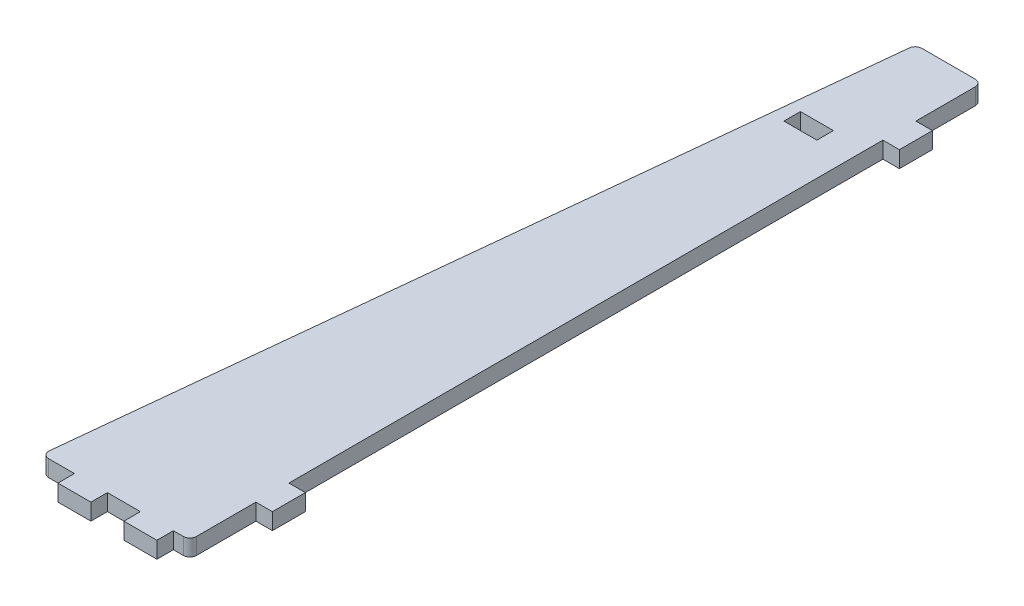
ISO-10303-21;
HEADER;
FILE_DESCRIPTION(('STEP AP214'),'2;1');
FILE_NAME('part.step','',(''),(''),'','','');
FILE_SCHEMA(('AUTOMOTIVE_DESIGN { 1 0 10303 214 1 1 1 1 }'));
ENDSEC;
DATA;
#1=APPLICATION_CONTEXT('core data for automotive mechanical design processes');
#2=APPLICATION_PROTOCOL_DEFINITION('international standard','automotive_design',2000,#1);
#3=PRODUCT_CONTEXT('',#1,'mechanical');
#4=PRODUCT('Part','Part','',(#3));
#5=PRODUCT_RELATED_PRODUCT_CATEGORY('part','',(#4));
#6=PRODUCT_DEFINITION_FORMATION('','',#4);
#7=PRODUCT_DEFINITION_CONTEXT('part definition',#1,'design');
#8=PRODUCT_DEFINITION('design','',#6,#7);
#9=PRODUCT_DEFINITION_SHAPE('','',#8);
#10=(LENGTH_UNIT() NAMED_UNIT(*) SI_UNIT(.MILLI.,.METRE.));
#11=(NAMED_UNIT(*) PLANE_ANGLE_UNIT() SI_UNIT($,.RADIAN.));
#12=(NAMED_UNIT(*) SI_UNIT($,.STERADIAN.) SOLID_ANGLE_UNIT());
#13=UNCERTAINTY_MEASURE_WITH_UNIT(LENGTH_MEASURE(1.E-05),#10,'distance_accuracy_value','');
#14=(GEOMETRIC_REPRESENTATION_CONTEXT(3) GLOBAL_UNCERTAINTY_ASSIGNED_CONTEXT((#13)) GLOBAL_UNIT_ASSIGNED_CONTEXT((#10,
#11,#12)) REPRESENTATION_CONTEXT('',''));
#15=CARTESIAN_POINT('',(0.,0.,0.));
#16=DIRECTION('',(0.,0.,1.));
#17=DIRECTION('',(1.,0.,0.));
#18=AXIS2_PLACEMENT_3D('',#15,#16,#17);
#19=CARTESIAN_POINT('',(0.,6.35,0.));
#20=DIRECTION('',(0.,1.,0.));
#21=DIRECTION('',(0.,0.,1.));
#22=AXIS2_PLACEMENT_3D('',#19,#20,#21);
#23=PLANE('',#22);
#24=DIRECTION('',(1.,0.,0.));
#25=VECTOR('',#24,1.);
#26=CARTESIAN_POINT('',(50.8,6.35,0.));
#27=LINE('',#26,#25);
#28=CARTESIAN_POINT('',(50.8,6.35,0.));
#29=VERTEX_POINT('',#28);
#30=CARTESIAN_POINT('',(54.61,6.35,0.));
#31=VERTEX_POINT('',#30);
#32=EDGE_CURVE('E282',#29,#31,#27,.T.);
#33=ORIENTED_EDGE('',*,*,#32,.T.);
#34=CARTESIAN_POINT('',(54.61,6.35,-2.54));
#35=DIRECTION('',(0.,1.,0.));
#36=DIRECTION('',(0.,0.,1.));
#37=AXIS2_PLACEMENT_3D('',#34,#35,#36);
#38=CIRCLE('',#37,2.54);
#39=CARTESIAN_POINT('',(57.15,6.35,-2.54));
#40=VERTEX_POINT('',#39);
#41=EDGE_CURVE('E412',#31,#40,#38,.T.);
#42=ORIENTED_EDGE('',*,*,#41,.T.);
#43=DIRECTION('',(0.,0.,-1.));
#44=VECTOR('',#43,1.);
#45=CARTESIAN_POINT('',(57.15,6.35,0.));
#46=LINE('',#45,#44);
#47=CARTESIAN_POINT('',(57.15,6.35,-25.4));
#48=VERTEX_POINT('',#47);
#49=EDGE_CURVE('E285',#40,#48,#46,.T.);
#50=ORIENTED_EDGE('',*,*,#49,.T.);
#51=DIRECTION('',(1.,0.,0.));
#52=VECTOR('',#51,1.);
#53=CARTESIAN_POINT('',(57.15,6.35,-25.4));
#54=LINE('',#53,#52);
#55=CARTESIAN_POINT('',(63.5,6.35,-25.4));
#56=VERTEX_POINT('',#55);
#57=EDGE_CURVE('E287',#48,#56,#54,.T.);
#58=ORIENTED_EDGE('',*,*,#57,.T.);
#59=DIRECTION('',(0.,0.,-1.));
#60=VECTOR('',#59,1.);
#61=CARTESIAN_POINT('',(63.5,6.35,-25.4));
#62=LINE('',#61,#60);
#63=CARTESIAN_POINT('',(63.5,6.35,-38.1));
#64=VERTEX_POINT('',#63);
#65=EDGE_CURVE('E289',#56,#64,#62,.T.);
#66=ORIENTED_EDGE('',*,*,#65,.T.);
#67=DIRECTION('',(-1.,0.,0.));
#68=VECTOR('',#67,1.);
#69=CARTESIAN_POINT('',(63.5,6.35,-38.1));
#70=LINE('',#69,#68);
#71=CARTESIAN_POINT('',(57.15,6.35,-38.1));
#72=VERTEX_POINT('',#71);
#73=EDGE_CURVE('E291',#64,#72,#70,.T.);
#74=ORIENTED_EDGE('',*,*,#73,.T.);
#75=DIRECTION('',(0.,0.,-1.));
#76=VECTOR('',#75,1.);
#77=CARTESIAN_POINT('',(57.15,6.35,-38.1));
#78=LINE('',#77,#76);
#79=CARTESIAN_POINT('',(57.15,6.35,-266.7));
#80=VERTEX_POINT('',#79);
#81=EDGE_CURVE('E293',#72,#80,#78,.T.);
#82=ORIENTED_EDGE('',*,*,#81,.T.);
#83=DIRECTION('',(1.,0.,0.));
#84=VECTOR('',#83,1.);
#85=CARTESIAN_POINT('',(57.15,6.35,-266.7));
#86=LINE('',#85,#84);
#87=CARTESIAN_POINT('',(63.5,6.35,-266.7));
#88=VERTEX_POINT('',#87);
#89=EDGE_CURVE('E295',#80,#88,#86,.T.);
#90=ORIENTED_EDGE('',*,*,#89,.T.);
#91=DIRECTION('',(0.,0.,-1.));
#92=VECTOR('',#91,1.);
#93=CARTESIAN_POINT('',(63.5,6.35,-266.7));
#94=LINE('',#93,#92);
#95=CARTESIAN_POINT('',(63.5,6.35,-279.4));
#96=VERTEX_POINT('',#95);
#97=EDGE_CURVE('E297',#88,#96,#94,.T.);
#98=ORIENTED_EDGE('',*,*,#97,.T.);
#99=DIRECTION('',(-1.,0.,0.));
#100=VECTOR('',#99,1.);
#101=CARTESIAN_POINT('',(63.5,6.35,-279.4));
#102=LINE('',#101,#100);
#103=CARTESIAN_POINT('',(57.15,6.35,-279.4));
#104=VERTEX_POINT('',#103);
#105=EDGE_CURVE('E299',#96,#104,#102,.T.);
#106=ORIENTED_EDGE('',*,*,#105,.T.);
#107=DIRECTION('',(0.,0.,-1.));
#108=VECTOR('',#107,1.);
#109=CARTESIAN_POINT('',(57.15,6.35,-279.4));
#110=LINE('',#109,#108);
#111=CARTESIAN_POINT('',(57.15,6.35,-302.26));
#112=VERTEX_POINT('',#111);
#113=EDGE_CURVE('E301',#104,#112,#110,.T.);
#114=ORIENTED_EDGE('',*,*,#113,.T.);
#115=CARTESIAN_POINT('',(54.61,6.35,-302.26));
#116=DIRECTION('',(0.,1.,0.));
#117=DIRECTION('',(0.,0.,1.));
#118=AXIS2_PLACEMENT_3D('',#115,#116,#117);
#119=CIRCLE('',#118,2.54);
#120=CARTESIAN_POINT('',(54.61,6.35,-304.8));
#121=VERTEX_POINT('',#120);
#122=EDGE_CURVE('E55',#112,#121,#119,.T.);
#123=ORIENTED_EDGE('',*,*,#122,.T.);
#124=DIRECTION('',(-1.,0.,0.));
#125=VECTOR('',#124,1.);
#126=CARTESIAN_POINT('',(57.15,6.35,-304.8));
#127=LINE('',#126,#125);
#128=CARTESIAN_POINT('',(34.0391598683762,6.35,-304.8));
#129=VERTEX_POINT('',#128);
#130=EDGE_CURVE('E303',#121,#129,#127,.T.);
#131=ORIENTED_EDGE('',*,*,#130,.T.);
#132=CARTESIAN_POINT('',(34.0391598683762,6.35,-302.26));
#133=DIRECTION('',(0.,1.,0.));
#134=DIRECTION('',(0.,0.,1.));
#135=AXIS2_PLACEMENT_3D('',#132,#133,#134);
#136=CIRCLE('',#135,2.54);
#137=CARTESIAN_POINT('',(31.5128291097936,6.35,-302.523159454019));
#138=VERTEX_POINT('',#137);
#139=EDGE_CURVE('E409',#129,#138,#136,.T.);
#140=ORIENTED_EDGE('',*,*,#139,.T.);
#141=DIRECTION('',(-0.103606084259456,0.,0.994618408890778));
#142=VECTOR('',#141,1.);
#143=CARTESIAN_POINT('',(31.75,6.35,-304.8));
#144=LINE('',#143,#142);
#145=CARTESIAN_POINT('',(0.291995776460316,6.35,-2.80315945401904));
#146=VERTEX_POINT('',#145);
#147=EDGE_CURVE('E262',#138,#146,#144,.T.);
#148=ORIENTED_EDGE('',*,*,#147,.T.);
#149=CARTESIAN_POINT('',(2.81832653504289,6.35,-2.54));
#150=DIRECTION('',(0.,1.,0.));
#151=DIRECTION('',(0.,0.,1.));
#152=AXIS2_PLACEMENT_3D('',#149,#150,#151);
#153=CIRCLE('',#152,2.54);
#154=CARTESIAN_POINT('',(2.81832653504289,6.35,0.));
#155=VERTEX_POINT('',#154);
#156=EDGE_CURVE('E407',#146,#155,#153,.T.);
#157=ORIENTED_EDGE('',*,*,#156,.T.);
#158=DIRECTION('',(1.,0.,0.));
#159=VECTOR('',#158,1.);
#160=CARTESIAN_POINT('',(0.,6.35,0.));
#161=LINE('',#160,#159);
#162=CARTESIAN_POINT('',(12.7,6.35,0.));
#163=VERTEX_POINT('',#162);
#164=EDGE_CURVE('E265',#155,#163,#161,.T.);
#165=ORIENTED_EDGE('',*,*,#164,.T.);
#166=DIRECTION('',(0.,0.,1.));
#167=VECTOR('',#166,1.);
#168=CARTESIAN_POINT('',(12.7,6.35,0.));
#169=LINE('',#168,#167);
#170=CARTESIAN_POINT('',(12.7,6.35,6.35));
#171=VERTEX_POINT('',#170);
#172=EDGE_CURVE('E268',#163,#171,#169,.T.);
#173=ORIENTED_EDGE('',*,*,#172,.T.);
#174=DIRECTION('',(1.,0.,0.));
#175=VECTOR('',#174,1.);
#176=CARTESIAN_POINT('',(12.7,6.35,6.35));
#177=LINE('',#176,#175);
#178=CARTESIAN_POINT('',(25.4,6.35,6.35));
#179=VERTEX_POINT('',#178);
#180=EDGE_CURVE('E270',#171,#179,#177,.T.);
#181=ORIENTED_EDGE('',*,*,#180,.T.);
#182=DIRECTION('',(0.,0.,-1.));
#183=VECTOR('',#182,1.);
#184=CARTESIAN_POINT('',(25.4,6.35,6.35));
#185=LINE('',#184,#183);
#186=CARTESIAN_POINT('',(25.4,6.35,0.));
#187=VERTEX_POINT('',#186);
#188=EDGE_CURVE('E272',#179,#187,#185,.T.);
#189=ORIENTED_EDGE('',*,*,#188,.T.);
#190=DIRECTION('',(1.,0.,0.));
#191=VECTOR('',#190,1.);
#192=CARTESIAN_POINT('',(25.4,6.35,0.));
#193=LINE('',#192,#191);
#194=CARTESIAN_POINT('',(38.1,6.35,0.));
#195=VERTEX_POINT('',#194);
#196=EDGE_CURVE('E274',#187,#195,#193,.T.);
#197=ORIENTED_EDGE('',*,*,#196,.T.);
#198=DIRECTION('',(0.,0.,1.));
#199=VECTOR('',#198,1.);
#200=CARTESIAN_POINT('',(38.1,6.35,0.));
#201=LINE('',#200,#199);
#202=CARTESIAN_POINT('',(38.1,6.35,6.35));
#203=VERTEX_POINT('',#202);
#204=EDGE_CURVE('E276',#195,#203,#201,.T.);
#205=ORIENTED_EDGE('',*,*,#204,.T.);
#206=DIRECTION('',(1.,0.,0.));
#207=VECTOR('',#206,1.);
#208=CARTESIAN_POINT('',(38.1,6.35,6.35));
#209=LINE('',#208,#207);
#210=CARTESIAN_POINT('',(50.8,6.35,6.35));
#211=VERTEX_POINT('',#210);
#212=EDGE_CURVE('E278',#203,#211,#209,.T.);
#213=ORIENTED_EDGE('',*,*,#212,.T.);
#214=DIRECTION('',(0.,0.,-1.));
#215=VECTOR('',#214,1.);
#216=CARTESIAN_POINT('',(50.8,6.35,6.35));
#217=LINE('',#216,#215);
#218=EDGE_CURVE('E280',#211,#29,#217,.T.);
#219=ORIENTED_EDGE('',*,*,#218,.T.);
#220=EDGE_LOOP('',(#33,#42,#50,#58,#66,#74,#82,#90,#98,#106,#114,#123,#131,#140,#148,#157,#165,
#173,#181,#189,#197,#205,#213,#219));
#221=FACE_BOUND('',#220,.T.);
#222=DIRECTION('',(0.,0.,1.));
#223=VECTOR('',#222,1.);
#224=CARTESIAN_POINT('',(31.75,6.35,-260.35));
#225=LINE('',#224,#223);
#226=CARTESIAN_POINT('',(31.75,6.35,-260.35));
#227=VERTEX_POINT('',#226);
#228=CARTESIAN_POINT('',(31.75,6.35,-254.));
#229=VERTEX_POINT('',#228);
#230=EDGE_CURVE('E231',#227,#229,#225,.T.);
#231=ORIENTED_EDGE('',*,*,#230,.F.);
#232=DIRECTION('',(-1.,0.,0.));
#233=VECTOR('',#232,1.);
#234=CARTESIAN_POINT('',(31.75,6.35,-260.35));
#235=LINE('',#234,#233);
#236=CARTESIAN_POINT('',(44.45,6.35,-260.35));
#237=VERTEX_POINT('',#236);
#238=EDGE_CURVE('E221',#237,#227,#235,.T.);
#239=ORIENTED_EDGE('',*,*,#238,.F.);
#240=DIRECTION('',(0.,0.,-1.));
#241=VECTOR('',#240,1.);
#242=CARTESIAN_POINT('',(44.45,6.35,-260.35));
#243=LINE('',#242,#241);
#244=CARTESIAN_POINT('',(44.45,6.35,-254.));
#245=VERTEX_POINT('',#244);
#246=EDGE_CURVE('E246',#245,#237,#243,.T.);
#247=ORIENTED_EDGE('',*,*,#246,.F.);
#248=DIRECTION('',(1.,0.,0.));
#249=VECTOR('',#248,1.);
#250=CARTESIAN_POINT('',(31.75,6.35,-254.));
#251=LINE('',#250,#249);
#252=EDGE_CURVE('E244',#229,#245,#251,.T.);
#253=ORIENTED_EDGE('',*,*,#252,.F.);
#254=EDGE_LOOP('',(#231,#239,#247,#253));
#255=FACE_BOUND('',#254,.T.);
#256=ADVANCED_FACE('F33',(#221,#255),#23,.T.);
#257=CARTESIAN_POINT('',(0.,0.,0.));
#258=DIRECTION('',(0.,1.,0.));
#259=DIRECTION('',(0.,0.,1.));
#260=AXIS2_PLACEMENT_3D('',#257,#258,#259);
#261=PLANE('',#260);
#262=DIRECTION('',(0.,0.,-1.));
#263=VECTOR('',#262,1.);
#264=CARTESIAN_POINT('',(57.15,0.,0.));
#265=LINE('',#264,#263);
#266=CARTESIAN_POINT('',(57.15,0.,-2.54));
#267=VERTEX_POINT('',#266);
#268=CARTESIAN_POINT('',(57.15,0.,-25.4));
#269=VERTEX_POINT('',#268);
#270=EDGE_CURVE('E327',#267,#269,#265,.T.);
#271=ORIENTED_EDGE('',*,*,#270,.F.);
#272=CARTESIAN_POINT('',(54.61,0.,-2.54));
#273=DIRECTION('',(0.,1.,0.));
#274=DIRECTION('',(0.,0.,1.));
#275=AXIS2_PLACEMENT_3D('',#272,#273,#274);
#276=CIRCLE('',#275,2.54);
#277=CARTESIAN_POINT('',(54.61,0.,0.));
#278=VERTEX_POINT('',#277);
#279=EDGE_CURVE('E403',#267,#278,#276,.F.);
#280=ORIENTED_EDGE('',*,*,#279,.T.);
#281=DIRECTION('',(1.,0.,0.));
#282=VECTOR('',#281,1.);
#283=CARTESIAN_POINT('',(50.8,0.,0.));
#284=LINE('',#283,#282);
#285=CARTESIAN_POINT('',(50.8,0.,0.));
#286=VERTEX_POINT('',#285);
#287=EDGE_CURVE('E324',#286,#278,#284,.T.);
#288=ORIENTED_EDGE('',*,*,#287,.F.);
#289=DIRECTION('',(0.,0.,-1.));
#290=VECTOR('',#289,1.);
#291=CARTESIAN_POINT('',(50.8,0.,6.35));
#292=LINE('',#291,#290);
#293=CARTESIAN_POINT('',(50.8,0.,6.35));
#294=VERTEX_POINT('',#293);
#295=EDGE_CURVE('E322',#294,#286,#292,.T.);
#296=ORIENTED_EDGE('',*,*,#295,.F.);
#297=DIRECTION('',(1.,0.,0.));
#298=VECTOR('',#297,1.);
#299=CARTESIAN_POINT('',(38.1,0.,6.35));
#300=LINE('',#299,#298);
#301=CARTESIAN_POINT('',(38.1,0.,6.35));
#302=VERTEX_POINT('',#301);
#303=EDGE_CURVE('E320',#302,#294,#300,.T.);
#304=ORIENTED_EDGE('',*,*,#303,.F.);
#305=DIRECTION('',(0.,0.,1.));
#306=VECTOR('',#305,1.);
#307=CARTESIAN_POINT('',(38.1,0.,0.));
#308=LINE('',#307,#306);
#309=CARTESIAN_POINT('',(38.1,0.,0.));
#310=VERTEX_POINT('',#309);
#311=EDGE_CURVE('E318',#310,#302,#308,.T.);
#312=ORIENTED_EDGE('',*,*,#311,.F.);
#313=DIRECTION('',(1.,0.,0.));
#314=VECTOR('',#313,1.);
#315=CARTESIAN_POINT('',(25.4,0.,0.));
#316=LINE('',#315,#314);
#317=CARTESIAN_POINT('',(25.4,0.,0.));
#318=VERTEX_POINT('',#317);
#319=EDGE_CURVE('E316',#318,#310,#316,.T.);
#320=ORIENTED_EDGE('',*,*,#319,.F.);
#321=DIRECTION('',(0.,0.,-1.));
#322=VECTOR('',#321,1.);
#323=CARTESIAN_POINT('',(25.4,0.,6.35));
#324=LINE('',#323,#322);
#325=CARTESIAN_POINT('',(25.4,0.,6.35));
#326=VERTEX_POINT('',#325);
#327=EDGE_CURVE('E314',#326,#318,#324,.T.);
#328=ORIENTED_EDGE('',*,*,#327,.F.);
#329=DIRECTION('',(1.,0.,0.));
#330=VECTOR('',#329,1.);
#331=CARTESIAN_POINT('',(12.7,0.,6.35));
#332=LINE('',#331,#330);
#333=CARTESIAN_POINT('',(12.7,0.,6.35));
#334=VERTEX_POINT('',#333);
#335=EDGE_CURVE('E312',#334,#326,#332,.T.);
#336=ORIENTED_EDGE('',*,*,#335,.F.);
#337=DIRECTION('',(0.,0.,1.));
#338=VECTOR('',#337,1.);
#339=CARTESIAN_POINT('',(12.7,0.,0.));
#340=LINE('',#339,#338);
#341=CARTESIAN_POINT('',(12.7,0.,0.));
#342=VERTEX_POINT('',#341);
#343=EDGE_CURVE('E310',#342,#334,#340,.T.);
#344=ORIENTED_EDGE('',*,*,#343,.F.);
#345=DIRECTION('',(1.,0.,0.));
#346=VECTOR('',#345,1.);
#347=CARTESIAN_POINT('',(0.,0.,0.));
#348=LINE('',#347,#346);
#349=CARTESIAN_POINT('',(2.81832653504289,0.,0.));
#350=VERTEX_POINT('',#349);
#351=EDGE_CURVE('E308',#350,#342,#348,.T.);
#352=ORIENTED_EDGE('',*,*,#351,.F.);
#353=CARTESIAN_POINT('',(2.81832653504289,0.,-2.54));
#354=DIRECTION('',(0.,1.,0.));
#355=DIRECTION('',(0.,0.,1.));
#356=AXIS2_PLACEMENT_3D('',#353,#354,#355);
#357=CIRCLE('',#356,2.54);
#358=CARTESIAN_POINT('',(0.291995776460316,0.,-2.80315945401904));
#359=VERTEX_POINT('',#358);
#360=EDGE_CURVE('E397',#350,#359,#357,.F.);
#361=ORIENTED_EDGE('',*,*,#360,.T.);
#362=DIRECTION('',(-0.103606084259456,0.,0.994618408890778));
#363=VECTOR('',#362,1.);
#364=CARTESIAN_POINT('',(31.75,0.,-304.8));
#365=LINE('',#364,#363);
#366=CARTESIAN_POINT('',(31.5128291097936,0.,-302.523159454019));
#367=VERTEX_POINT('',#366);
#368=EDGE_CURVE('E239',#367,#359,#365,.T.);
#369=ORIENTED_EDGE('',*,*,#368,.F.);
#370=CARTESIAN_POINT('',(34.0391598683762,0.,-302.26));
#371=DIRECTION('',(0.,1.,0.));
#372=DIRECTION('',(0.,0.,1.));
#373=AXIS2_PLACEMENT_3D('',#370,#371,#372);
#374=CIRCLE('',#373,2.54);
#375=CARTESIAN_POINT('',(34.0391598683762,0.,-304.8));
#376=VERTEX_POINT('',#375);
#377=EDGE_CURVE('E399',#367,#376,#374,.F.);
#378=ORIENTED_EDGE('',*,*,#377,.T.);
#379=DIRECTION('',(-1.,0.,0.));
#380=VECTOR('',#379,1.);
#381=CARTESIAN_POINT('',(57.15,0.,-304.8));
#382=LINE('',#381,#380);
#383=CARTESIAN_POINT('',(54.61,0.,-304.8));
#384=VERTEX_POINT('',#383);
#385=EDGE_CURVE('E266',#384,#376,#382,.T.);
#386=ORIENTED_EDGE('',*,*,#385,.F.);
#387=CARTESIAN_POINT('',(54.61,0.,-302.26));
#388=DIRECTION('',(0.,1.,0.));
#389=DIRECTION('',(0.,0.,1.));
#390=AXIS2_PLACEMENT_3D('',#387,#388,#389);
#391=CIRCLE('',#390,2.54);
#392=CARTESIAN_POINT('',(57.15,0.,-302.26));
#393=VERTEX_POINT('',#392);
#394=EDGE_CURVE('E401',#384,#393,#391,.F.);
#395=ORIENTED_EDGE('',*,*,#394,.T.);
#396=DIRECTION('',(0.,0.,-1.));
#397=VECTOR('',#396,1.);
#398=CARTESIAN_POINT('',(57.15,0.,-279.4));
#399=LINE('',#398,#397);
#400=CARTESIAN_POINT('',(57.15,0.,-279.4));
#401=VERTEX_POINT('',#400);
#402=EDGE_CURVE('E343',#401,#393,#399,.T.);
#403=ORIENTED_EDGE('',*,*,#402,.F.);
#404=DIRECTION('',(-1.,0.,0.));
#405=VECTOR('',#404,1.);
#406=CARTESIAN_POINT('',(63.5,0.,-279.4));
#407=LINE('',#406,#405);
#408=CARTESIAN_POINT('',(63.5,0.,-279.4));
#409=VERTEX_POINT('',#408);
#410=EDGE_CURVE('E341',#409,#401,#407,.T.);
#411=ORIENTED_EDGE('',*,*,#410,.F.);
#412=DIRECTION('',(0.,0.,-1.));
#413=VECTOR('',#412,1.);
#414=CARTESIAN_POINT('',(63.5,0.,-266.7));
#415=LINE('',#414,#413);
#416=CARTESIAN_POINT('',(63.5,0.,-266.7));
#417=VERTEX_POINT('',#416);
#418=EDGE_CURVE('E339',#417,#409,#415,.T.);
#419=ORIENTED_EDGE('',*,*,#418,.F.);
#420=DIRECTION('',(1.,0.,0.));
#421=VECTOR('',#420,1.);
#422=CARTESIAN_POINT('',(57.15,0.,-266.7));
#423=LINE('',#422,#421);
#424=CARTESIAN_POINT('',(57.15,0.,-266.7));
#425=VERTEX_POINT('',#424);
#426=EDGE_CURVE('E337',#425,#417,#423,.T.);
#427=ORIENTED_EDGE('',*,*,#426,.F.);
#428=DIRECTION('',(0.,0.,-1.));
#429=VECTOR('',#428,1.);
#430=CARTESIAN_POINT('',(57.15,0.,-38.1));
#431=LINE('',#430,#429);
#432=CARTESIAN_POINT('',(57.15,0.,-38.1));
#433=VERTEX_POINT('',#432);
#434=EDGE_CURVE('E335',#433,#425,#431,.T.);
#435=ORIENTED_EDGE('',*,*,#434,.F.);
#436=DIRECTION('',(-1.,0.,0.));
#437=VECTOR('',#436,1.);
#438=CARTESIAN_POINT('',(63.5,0.,-38.1));
#439=LINE('',#438,#437);
#440=CARTESIAN_POINT('',(63.5,0.,-38.1));
#441=VERTEX_POINT('',#440);
#442=EDGE_CURVE('E333',#441,#433,#439,.T.);
#443=ORIENTED_EDGE('',*,*,#442,.F.);
#444=DIRECTION('',(0.,0.,-1.));
#445=VECTOR('',#444,1.);
#446=CARTESIAN_POINT('',(63.5,0.,-25.4));
#447=LINE('',#446,#445);
#448=CARTESIAN_POINT('',(63.5,0.,-25.4));
#449=VERTEX_POINT('',#448);
#450=EDGE_CURVE('E331',#449,#441,#447,.T.);
#451=ORIENTED_EDGE('',*,*,#450,.F.);
#452=DIRECTION('',(1.,0.,0.));
#453=VECTOR('',#452,1.);
#454=CARTESIAN_POINT('',(57.15,0.,-25.4));
#455=LINE('',#454,#453);
#456=EDGE_CURVE('E329',#269,#449,#455,.T.);
#457=ORIENTED_EDGE('',*,*,#456,.F.);
#458=EDGE_LOOP('',(#271,#280,#288,#296,#304,#312,#320,#328,#336,#344,#352,#361,#369,#378,#386,
#395,#403,#411,#419,#427,#435,#443,#451,#457));
#459=FACE_BOUND('',#458,.T.);
#460=DIRECTION('',(-1.,0.,0.));
#461=VECTOR('',#460,1.);
#462=CARTESIAN_POINT('',(31.75,0.,-260.35));
#463=LINE('',#462,#461);
#464=CARTESIAN_POINT('',(44.45,0.,-260.35));
#465=VERTEX_POINT('',#464);
#466=CARTESIAN_POINT('',(31.75,0.,-260.35));
#467=VERTEX_POINT('',#466);
#468=EDGE_CURVE('E250',#465,#467,#463,.T.);
#469=ORIENTED_EDGE('',*,*,#468,.T.);
#470=DIRECTION('',(0.,0.,1.));
#471=VECTOR('',#470,1.);
#472=CARTESIAN_POINT('',(31.75,0.,-260.35));
#473=LINE('',#472,#471);
#474=CARTESIAN_POINT('',(31.75,0.,-254.));
#475=VERTEX_POINT('',#474);
#476=EDGE_CURVE('E238',#467,#475,#473,.T.);
#477=ORIENTED_EDGE('',*,*,#476,.T.);
#478=DIRECTION('',(1.,0.,0.));
#479=VECTOR('',#478,1.);
#480=CARTESIAN_POINT('',(31.75,0.,-254.));
#481=LINE('',#480,#479);
#482=CARTESIAN_POINT('',(44.45,0.,-254.));
#483=VERTEX_POINT('',#482);
#484=EDGE_CURVE('E253',#475,#483,#481,.T.);
#485=ORIENTED_EDGE('',*,*,#484,.T.);
#486=DIRECTION('',(0.,0.,-1.));
#487=VECTOR('',#486,1.);
#488=CARTESIAN_POINT('',(44.45,0.,-260.35));
#489=LINE('',#488,#487);
#490=EDGE_CURVE('E232',#483,#465,#489,.T.);
#491=ORIENTED_EDGE('',*,*,#490,.T.);
#492=EDGE_LOOP('',(#469,#477,#485,#491));
#493=FACE_BOUND('',#492,.T.);
#494=ADVANCED_FACE('F432',(#459,#493),#261,.F.);
#495=CARTESIAN_POINT('',(31.75,6.35,-304.8));
#496=DIRECTION('',(0.994618408890778,0.,0.103606084259456));
#497=DIRECTION('',(0.103606084259456,0.,-0.994618408890778));
#498=AXIS2_PLACEMENT_3D('',#495,#496,#497);
#499=PLANE('',#498);
#500=ORIENTED_EDGE('',*,*,#147,.F.);
#501=DIRECTION('',(0.,-1.,0.));
#502=VECTOR('',#501,1.);
#503=CARTESIAN_POINT('',(31.5128291097936,6.35,-302.523159454019));
#504=LINE('',#503,#502);
#505=EDGE_CURVE('E41',#138,#367,#504,.T.);
#506=ORIENTED_EDGE('',*,*,#505,.T.);
#507=ORIENTED_EDGE('',*,*,#368,.T.);
#508=DIRECTION('',(0.,-1.,0.));
#509=VECTOR('',#508,1.);
#510=CARTESIAN_POINT('',(0.291995776460316,6.35,-2.80315945401904));
#511=LINE('',#510,#509);
#512=EDGE_CURVE('E420',#359,#146,#511,.F.);
#513=ORIENTED_EDGE('',*,*,#512,.T.);
#514=EDGE_LOOP('',(#500,#506,#507,#513));
#515=FACE_BOUND('',#514,.T.);
#516=ADVANCED_FACE('F426',(#515),#499,.F.);
#517=CARTESIAN_POINT('',(0.,6.35,0.));
#518=DIRECTION('',(0.,0.,-1.));
#519=DIRECTION('',(-1.,0.,0.));
#520=AXIS2_PLACEMENT_3D('',#517,#518,#519);
#521=PLANE('',#520);
#522=ORIENTED_EDGE('',*,*,#164,.F.);
#523=DIRECTION('',(0.,-1.,0.));
#524=VECTOR('',#523,1.);
#525=CARTESIAN_POINT('',(2.81832653504289,6.35,0.));
#526=LINE('',#525,#524);
#527=EDGE_CURVE('E11',#155,#350,#526,.T.);
#528=ORIENTED_EDGE('',*,*,#527,.T.);
#529=ORIENTED_EDGE('',*,*,#351,.T.);
#530=DIRECTION('',(0.,-1.,0.));
#531=VECTOR('',#530,1.);
#532=CARTESIAN_POINT('',(12.7,6.35,0.));
#533=LINE('',#532,#531);
#534=EDGE_CURVE('E391',#163,#342,#533,.T.);
#535=ORIENTED_EDGE('',*,*,#534,.F.);
#536=EDGE_LOOP('',(#522,#528,#529,#535));
#537=FACE_BOUND('',#536,.T.);
#538=ADVANCED_FACE('F442',(#537),#521,.F.);
#539=CARTESIAN_POINT('',(12.7,6.35,0.));
#540=DIRECTION('',(1.,0.,0.));
#541=DIRECTION('',(0.,0.,-1.));
#542=AXIS2_PLACEMENT_3D('',#539,#540,#541);
#543=PLANE('',#542);
#544=ORIENTED_EDGE('',*,*,#343,.T.);
#545=DIRECTION('',(0.,-1.,0.));
#546=VECTOR('',#545,1.);
#547=CARTESIAN_POINT('',(12.7,6.35,6.35));
#548=LINE('',#547,#546);
#549=EDGE_CURVE('E388',#171,#334,#548,.T.);
#550=ORIENTED_EDGE('',*,*,#549,.F.);
#551=ORIENTED_EDGE('',*,*,#172,.F.);
#552=ORIENTED_EDGE('',*,*,#534,.T.);
#553=EDGE_LOOP('',(#544,#550,#551,#552));
#554=FACE_BOUND('',#553,.T.);
#555=ADVANCED_FACE('F531',(#554),#543,.F.);
#556=CARTESIAN_POINT('',(12.7,6.35,6.35));
#557=DIRECTION('',(0.,0.,-1.));
#558=DIRECTION('',(-1.,0.,0.));
#559=AXIS2_PLACEMENT_3D('',#556,#557,#558);
#560=PLANE('',#559);
#561=ORIENTED_EDGE('',*,*,#335,.T.);
#562=DIRECTION('',(0.,-1.,0.));
#563=VECTOR('',#562,1.);
#564=CARTESIAN_POINT('',(25.4,6.35,6.35));
#565=LINE('',#564,#563);
#566=EDGE_CURVE('E385',#179,#326,#565,.T.);
#567=ORIENTED_EDGE('',*,*,#566,.F.);
#568=ORIENTED_EDGE('',*,*,#180,.F.);
#569=ORIENTED_EDGE('',*,*,#549,.T.);
#570=EDGE_LOOP('',(#561,#567,#568,#569));
#571=FACE_BOUND('',#570,.T.);
#572=ADVANCED_FACE('F527',(#571),#560,.F.);
#573=CARTESIAN_POINT('',(25.4,6.35,6.35));
#574=DIRECTION('',(-1.,0.,0.));
#575=DIRECTION('',(0.,0.,1.));
#576=AXIS2_PLACEMENT_3D('',#573,#574,#575);
#577=PLANE('',#576);
#578=ORIENTED_EDGE('',*,*,#327,.T.);
#579=DIRECTION('',(0.,-1.,0.));
#580=VECTOR('',#579,1.);
#581=CARTESIAN_POINT('',(25.4,6.35,0.));
#582=LINE('',#581,#580);
#583=EDGE_CURVE('E382',#187,#318,#582,.T.);
#584=ORIENTED_EDGE('',*,*,#583,.F.);
#585=ORIENTED_EDGE('',*,*,#188,.F.);
#586=ORIENTED_EDGE('',*,*,#566,.T.);
#587=EDGE_LOOP('',(#578,#584,#585,#586));
#588=FACE_BOUND('',#587,.T.);
#589=ADVANCED_FACE('F523',(#588),#577,.F.);
#590=CARTESIAN_POINT('',(25.4,6.35,0.));
#591=DIRECTION('',(0.,0.,-1.));
#592=DIRECTION('',(-1.,0.,0.));
#593=AXIS2_PLACEMENT_3D('',#590,#591,#592);
#594=PLANE('',#593);
#595=ORIENTED_EDGE('',*,*,#319,.T.);
#596=DIRECTION('',(0.,-1.,0.));
#597=VECTOR('',#596,1.);
#598=CARTESIAN_POINT('',(38.1,6.35,0.));
#599=LINE('',#598,#597);
#600=EDGE_CURVE('E379',#195,#310,#599,.T.);
#601=ORIENTED_EDGE('',*,*,#600,.F.);
#602=ORIENTED_EDGE('',*,*,#196,.F.);
#603=ORIENTED_EDGE('',*,*,#583,.T.);
#604=EDGE_LOOP('',(#595,#601,#602,#603));
#605=FACE_BOUND('',#604,.T.);
#606=ADVANCED_FACE('F519',(#605),#594,.F.);
#607=CARTESIAN_POINT('',(38.1,6.35,0.));
#608=DIRECTION('',(1.,0.,0.));
#609=DIRECTION('',(0.,0.,-1.));
#610=AXIS2_PLACEMENT_3D('',#607,#608,#609);
#611=PLANE('',#610);
#612=ORIENTED_EDGE('',*,*,#311,.T.);
#613=DIRECTION('',(0.,-1.,0.));
#614=VECTOR('',#613,1.);
#615=CARTESIAN_POINT('',(38.1,6.35,6.35));
#616=LINE('',#615,#614);
#617=EDGE_CURVE('E376',#203,#302,#616,.T.);
#618=ORIENTED_EDGE('',*,*,#617,.F.);
#619=ORIENTED_EDGE('',*,*,#204,.F.);
#620=ORIENTED_EDGE('',*,*,#600,.T.);
#621=EDGE_LOOP('',(#612,#618,#619,#620));
#622=FACE_BOUND('',#621,.T.);
#623=ADVANCED_FACE('F515',(#622),#611,.F.);
#624=CARTESIAN_POINT('',(38.1,6.35,6.35));
#625=DIRECTION('',(0.,0.,-1.));
#626=DIRECTION('',(-1.,0.,0.));
#627=AXIS2_PLACEMENT_3D('',#624,#625,#626);
#628=PLANE('',#627);
#629=ORIENTED_EDGE('',*,*,#303,.T.);
#630=DIRECTION('',(0.,-1.,0.));
#631=VECTOR('',#630,1.);
#632=CARTESIAN_POINT('',(50.8,6.35,6.35));
#633=LINE('',#632,#631);
#634=EDGE_CURVE('E373',#211,#294,#633,.T.);
#635=ORIENTED_EDGE('',*,*,#634,.F.);
#636=ORIENTED_EDGE('',*,*,#212,.F.);
#637=ORIENTED_EDGE('',*,*,#617,.T.);
#638=EDGE_LOOP('',(#629,#635,#636,#637));
#639=FACE_BOUND('',#638,.T.);
#640=ADVANCED_FACE('F511',(#639),#628,.F.);
#641=CARTESIAN_POINT('',(50.8,6.35,6.35));
#642=DIRECTION('',(-1.,0.,0.));
#643=DIRECTION('',(0.,0.,1.));
#644=AXIS2_PLACEMENT_3D('',#641,#642,#643);
#645=PLANE('',#644);
#646=ORIENTED_EDGE('',*,*,#295,.T.);
#647=DIRECTION('',(0.,-1.,0.));
#648=VECTOR('',#647,1.);
#649=CARTESIAN_POINT('',(50.8,6.35,0.));
#650=LINE('',#649,#648);
#651=EDGE_CURVE('E370',#29,#286,#650,.T.);
#652=ORIENTED_EDGE('',*,*,#651,.F.);
#653=ORIENTED_EDGE('',*,*,#218,.F.);
#654=ORIENTED_EDGE('',*,*,#634,.T.);
#655=EDGE_LOOP('',(#646,#652,#653,#654));
#656=FACE_BOUND('',#655,.T.);
#657=ADVANCED_FACE('F507',(#656),#645,.F.);
#658=CARTESIAN_POINT('',(50.8,6.35,0.));
#659=DIRECTION('',(0.,0.,-1.));
#660=DIRECTION('',(-1.,0.,0.));
#661=AXIS2_PLACEMENT_3D('',#658,#659,#660);
#662=PLANE('',#661);
#663=ORIENTED_EDGE('',*,*,#287,.T.);
#664=DIRECTION('',(0.,-1.,0.));
#665=VECTOR('',#664,1.);
#666=CARTESIAN_POINT('',(54.61,6.35,0.));
#667=LINE('',#666,#665);
#668=EDGE_CURVE('E405',#278,#31,#667,.F.);
#669=ORIENTED_EDGE('',*,*,#668,.T.);
#670=ORIENTED_EDGE('',*,*,#32,.F.);
#671=ORIENTED_EDGE('',*,*,#651,.T.);
#672=EDGE_LOOP('',(#663,#669,#670,#671));
#673=FACE_BOUND('',#672,.T.);
#674=ADVANCED_FACE('F503',(#673),#662,.F.);
#675=CARTESIAN_POINT('',(57.15,6.35,0.));
#676=DIRECTION('',(-1.,0.,0.));
#677=DIRECTION('',(0.,0.,1.));
#678=AXIS2_PLACEMENT_3D('',#675,#676,#677);
#679=PLANE('',#678);
#680=ORIENTED_EDGE('',*,*,#49,.F.);
#681=DIRECTION('',(0.,-1.,0.));
#682=VECTOR('',#681,1.);
#683=CARTESIAN_POINT('',(57.15,6.35,-2.54));
#684=LINE('',#683,#682);
#685=EDGE_CURVE('E394',#40,#267,#684,.T.);
#686=ORIENTED_EDGE('',*,*,#685,.T.);
#687=ORIENTED_EDGE('',*,*,#270,.T.);
#688=DIRECTION('',(0.,-1.,0.));
#689=VECTOR('',#688,1.);
#690=CARTESIAN_POINT('',(57.15,6.35,-25.4));
#691=LINE('',#690,#689);
#692=EDGE_CURVE('E367',#48,#269,#691,.T.);
#693=ORIENTED_EDGE('',*,*,#692,.F.);
#694=EDGE_LOOP('',(#680,#686,#687,#693));
#695=FACE_BOUND('',#694,.T.);
#696=ADVANCED_FACE('F499',(#695),#679,.F.);
#697=CARTESIAN_POINT('',(57.15,6.35,-25.4));
#698=DIRECTION('',(0.,0.,-1.));
#699=DIRECTION('',(-1.,0.,0.));
#700=AXIS2_PLACEMENT_3D('',#697,#698,#699);
#701=PLANE('',#700);
#702=ORIENTED_EDGE('',*,*,#456,.T.);
#703=DIRECTION('',(0.,-1.,0.));
#704=VECTOR('',#703,1.);
#705=CARTESIAN_POINT('',(63.5,6.35,-25.4));
#706=LINE('',#705,#704);
#707=EDGE_CURVE('E364',#56,#449,#706,.T.);
#708=ORIENTED_EDGE('',*,*,#707,.F.);
#709=ORIENTED_EDGE('',*,*,#57,.F.);
#710=ORIENTED_EDGE('',*,*,#692,.T.);
#711=EDGE_LOOP('',(#702,#708,#709,#710));
#712=FACE_BOUND('',#711,.T.);
#713=ADVANCED_FACE('F495',(#712),#701,.F.);
#714=CARTESIAN_POINT('',(63.5,6.35,-25.4));
#715=DIRECTION('',(-1.,0.,0.));
#716=DIRECTION('',(0.,0.,1.));
#717=AXIS2_PLACEMENT_3D('',#714,#715,#716);
#718=PLANE('',#717);
#719=ORIENTED_EDGE('',*,*,#450,.T.);
#720=DIRECTION('',(0.,-1.,0.));
#721=VECTOR('',#720,1.);
#722=CARTESIAN_POINT('',(63.5,6.35,-38.1));
#723=LINE('',#722,#721);
#724=EDGE_CURVE('E361',#64,#441,#723,.T.);
#725=ORIENTED_EDGE('',*,*,#724,.F.);
#726=ORIENTED_EDGE('',*,*,#65,.F.);
#727=ORIENTED_EDGE('',*,*,#707,.T.);
#728=EDGE_LOOP('',(#719,#725,#726,#727));
#729=FACE_BOUND('',#728,.T.);
#730=ADVANCED_FACE('F491',(#729),#718,.F.);
#731=CARTESIAN_POINT('',(63.5,6.35,-38.1));
#732=DIRECTION('',(0.,0.,1.));
#733=DIRECTION('',(1.,0.,0.));
#734=AXIS2_PLACEMENT_3D('',#731,#732,#733);
#735=PLANE('',#734);
#736=ORIENTED_EDGE('',*,*,#442,.T.);
#737=DIRECTION('',(0.,-1.,0.));
#738=VECTOR('',#737,1.);
#739=CARTESIAN_POINT('',(57.15,6.35,-38.1));
#740=LINE('',#739,#738);
#741=EDGE_CURVE('E358',#72,#433,#740,.T.);
#742=ORIENTED_EDGE('',*,*,#741,.F.);
#743=ORIENTED_EDGE('',*,*,#73,.F.);
#744=ORIENTED_EDGE('',*,*,#724,.T.);
#745=EDGE_LOOP('',(#736,#742,#743,#744));
#746=FACE_BOUND('',#745,.T.);
#747=ADVANCED_FACE('F487',(#746),#735,.F.);
#748=CARTESIAN_POINT('',(57.15,6.35,-38.1));
#749=DIRECTION('',(-1.,0.,0.));
#750=DIRECTION('',(0.,0.,1.));
#751=AXIS2_PLACEMENT_3D('',#748,#749,#750);
#752=PLANE('',#751);
#753=ORIENTED_EDGE('',*,*,#434,.T.);
#754=DIRECTION('',(0.,-1.,0.));
#755=VECTOR('',#754,1.);
#756=CARTESIAN_POINT('',(57.15,6.35,-266.7));
#757=LINE('',#756,#755);
#758=EDGE_CURVE('E355',#80,#425,#757,.T.);
#759=ORIENTED_EDGE('',*,*,#758,.F.);
#760=ORIENTED_EDGE('',*,*,#81,.F.);
#761=ORIENTED_EDGE('',*,*,#741,.T.);
#762=EDGE_LOOP('',(#753,#759,#760,#761));
#763=FACE_BOUND('',#762,.T.);
#764=ADVANCED_FACE('F483',(#763),#752,.F.);
#765=CARTESIAN_POINT('',(57.15,6.35,-266.7));
#766=DIRECTION('',(0.,0.,-1.));
#767=DIRECTION('',(-1.,0.,0.));
#768=AXIS2_PLACEMENT_3D('',#765,#766,#767);
#769=PLANE('',#768);
#770=ORIENTED_EDGE('',*,*,#426,.T.);
#771=DIRECTION('',(0.,-1.,0.));
#772=VECTOR('',#771,1.);
#773=CARTESIAN_POINT('',(63.5,6.35,-266.7));
#774=LINE('',#773,#772);
#775=EDGE_CURVE('E352',#88,#417,#774,.T.);
#776=ORIENTED_EDGE('',*,*,#775,.F.);
#777=ORIENTED_EDGE('',*,*,#89,.F.);
#778=ORIENTED_EDGE('',*,*,#758,.T.);
#779=EDGE_LOOP('',(#770,#776,#777,#778));
#780=FACE_BOUND('',#779,.T.);
#781=ADVANCED_FACE('F479',(#780),#769,.F.);
#782=CARTESIAN_POINT('',(63.5,6.35,-266.7));
#783=DIRECTION('',(-1.,0.,0.));
#784=DIRECTION('',(0.,0.,1.));
#785=AXIS2_PLACEMENT_3D('',#782,#783,#784);
#786=PLANE('',#785);
#787=ORIENTED_EDGE('',*,*,#418,.T.);
#788=DIRECTION('',(0.,-1.,0.));
#789=VECTOR('',#788,1.);
#790=CARTESIAN_POINT('',(63.5,6.35,-279.4));
#791=LINE('',#790,#789);
#792=EDGE_CURVE('E349',#96,#409,#791,.T.);
#793=ORIENTED_EDGE('',*,*,#792,.F.);
#794=ORIENTED_EDGE('',*,*,#97,.F.);
#795=ORIENTED_EDGE('',*,*,#775,.T.);
#796=EDGE_LOOP('',(#787,#793,#794,#795));
#797=FACE_BOUND('',#796,.T.);
#798=ADVANCED_FACE('F475',(#797),#786,.F.);
#799=CARTESIAN_POINT('',(63.5,6.35,-279.4));
#800=DIRECTION('',(0.,0.,1.));
#801=DIRECTION('',(1.,0.,0.));
#802=AXIS2_PLACEMENT_3D('',#799,#800,#801);
#803=PLANE('',#802);
#804=ORIENTED_EDGE('',*,*,#410,.T.);
#805=DIRECTION('',(0.,-1.,0.));
#806=VECTOR('',#805,1.);
#807=CARTESIAN_POINT('',(57.15,6.35,-279.4));
#808=LINE('',#807,#806);
#809=EDGE_CURVE('E305',#104,#401,#808,.T.);
#810=ORIENTED_EDGE('',*,*,#809,.F.);
#811=ORIENTED_EDGE('',*,*,#105,.F.);
#812=ORIENTED_EDGE('',*,*,#792,.T.);
#813=EDGE_LOOP('',(#804,#810,#811,#812));
#814=FACE_BOUND('',#813,.T.);
#815=ADVANCED_FACE('F471',(#814),#803,.F.);
#816=CARTESIAN_POINT('',(57.15,6.35,-279.4));
#817=DIRECTION('',(-1.,0.,0.));
#818=DIRECTION('',(0.,0.,1.));
#819=AXIS2_PLACEMENT_3D('',#816,#817,#818);
#820=PLANE('',#819);
#821=ORIENTED_EDGE('',*,*,#402,.T.);
#822=DIRECTION('',(0.,-1.,0.));
#823=VECTOR('',#822,1.);
#824=CARTESIAN_POINT('',(57.15,6.35,-302.26));
#825=LINE('',#824,#823);
#826=EDGE_CURVE('E418',#393,#112,#825,.F.);
#827=ORIENTED_EDGE('',*,*,#826,.T.);
#828=ORIENTED_EDGE('',*,*,#113,.F.);
#829=ORIENTED_EDGE('',*,*,#809,.T.);
#830=EDGE_LOOP('',(#821,#827,#828,#829));
#831=FACE_BOUND('',#830,.T.);
#832=ADVANCED_FACE('F468',(#831),#820,.F.);
#833=CARTESIAN_POINT('',(57.15,6.35,-304.8));
#834=DIRECTION('',(0.,0.,1.));
#835=DIRECTION('',(1.,0.,0.));
#836=AXIS2_PLACEMENT_3D('',#833,#834,#835);
#837=PLANE('',#836);
#838=ORIENTED_EDGE('',*,*,#130,.F.);
#839=DIRECTION('',(0.,-1.,0.));
#840=VECTOR('',#839,1.);
#841=CARTESIAN_POINT('',(54.61,6.35,-304.8));
#842=LINE('',#841,#840);
#843=EDGE_CURVE('E415',#121,#384,#842,.T.);
#844=ORIENTED_EDGE('',*,*,#843,.T.);
#845=ORIENTED_EDGE('',*,*,#385,.T.);
#846=DIRECTION('',(0.,-1.,0.));
#847=VECTOR('',#846,1.);
#848=CARTESIAN_POINT('',(34.0391598683762,6.35,-304.8));
#849=LINE('',#848,#847);
#850=EDGE_CURVE('E48',#376,#129,#849,.F.);
#851=ORIENTED_EDGE('',*,*,#850,.T.);
#852=EDGE_LOOP('',(#838,#844,#845,#851));
#853=FACE_BOUND('',#852,.T.);
#854=ADVANCED_FACE('F465',(#853),#837,.F.);
#855=CARTESIAN_POINT('',(31.75,6.35,-260.35));
#856=DIRECTION('',(0.,0.,1.));
#857=DIRECTION('',(1.,0.,0.));
#858=AXIS2_PLACEMENT_3D('',#855,#856,#857);
#859=PLANE('',#858);
#860=ORIENTED_EDGE('',*,*,#468,.F.);
#861=DIRECTION('',(0.,-1.,0.));
#862=VECTOR('',#861,1.);
#863=CARTESIAN_POINT('',(44.45,6.35,-260.35));
#864=LINE('',#863,#862);
#865=EDGE_CURVE('E227',#237,#465,#864,.T.);
#866=ORIENTED_EDGE('',*,*,#865,.F.);
#867=ORIENTED_EDGE('',*,*,#238,.T.);
#868=DIRECTION('',(0.,-1.,0.));
#869=VECTOR('',#868,1.);
#870=CARTESIAN_POINT('',(31.75,6.35,-260.35));
#871=LINE('',#870,#869);
#872=EDGE_CURVE('E224',#227,#467,#871,.T.);
#873=ORIENTED_EDGE('',*,*,#872,.T.);
#874=EDGE_LOOP('',(#860,#866,#867,#873));
#875=FACE_BOUND('',#874,.T.);
#876=ADVANCED_FACE('F223',(#875),#859,.T.);
#877=CARTESIAN_POINT('',(31.75,6.35,-260.35));
#878=DIRECTION('',(1.,0.,0.));
#879=DIRECTION('',(0.,0.,-1.));
#880=AXIS2_PLACEMENT_3D('',#877,#878,#879);
#881=PLANE('',#880);
#882=ORIENTED_EDGE('',*,*,#476,.F.);
#883=ORIENTED_EDGE('',*,*,#872,.F.);
#884=ORIENTED_EDGE('',*,*,#230,.T.);
#885=DIRECTION('',(0.,-1.,0.));
#886=VECTOR('',#885,1.);
#887=CARTESIAN_POINT('',(31.75,6.35,-254.));
#888=LINE('',#887,#886);
#889=EDGE_CURVE('E240',#229,#475,#888,.T.);
#890=ORIENTED_EDGE('',*,*,#889,.T.);
#891=EDGE_LOOP('',(#882,#883,#884,#890));
#892=FACE_BOUND('',#891,.T.);
#893=ADVANCED_FACE('F235',(#892),#881,.T.);
#894=CARTESIAN_POINT('',(31.75,6.35,-254.));
#895=DIRECTION('',(0.,0.,-1.));
#896=DIRECTION('',(-1.,0.,0.));
#897=AXIS2_PLACEMENT_3D('',#894,#895,#896);
#898=PLANE('',#897);
#899=ORIENTED_EDGE('',*,*,#484,.F.);
#900=ORIENTED_EDGE('',*,*,#889,.F.);
#901=ORIENTED_EDGE('',*,*,#252,.T.);
#902=DIRECTION('',(0.,-1.,0.));
#903=VECTOR('',#902,1.);
#904=CARTESIAN_POINT('',(44.45,6.35,-254.));
#905=LINE('',#904,#903);
#906=EDGE_CURVE('E259',#245,#483,#905,.T.);
#907=ORIENTED_EDGE('',*,*,#906,.T.);
#908=EDGE_LOOP('',(#899,#900,#901,#907));
#909=FACE_BOUND('',#908,.T.);
#910=ADVANCED_FACE('F546',(#909),#898,.T.);
#911=CARTESIAN_POINT('',(44.45,6.35,-260.35));
#912=DIRECTION('',(-1.,0.,0.));
#913=DIRECTION('',(0.,0.,1.));
#914=AXIS2_PLACEMENT_3D('',#911,#912,#913);
#915=PLANE('',#914);
#916=ORIENTED_EDGE('',*,*,#490,.F.);
#917=ORIENTED_EDGE('',*,*,#906,.F.);
#918=ORIENTED_EDGE('',*,*,#246,.T.);
#919=ORIENTED_EDGE('',*,*,#865,.T.);
#920=EDGE_LOOP('',(#916,#917,#918,#919));
#921=FACE_BOUND('',#920,.T.);
#922=ADVANCED_FACE('F541',(#921),#915,.T.);
#923=CARTESIAN_POINT('',(54.61,6.35,-2.54));
#924=DIRECTION('',(0.,-1.,0.));
#925=DIRECTION('',(0.,0.,-1.));
#926=AXIS2_PLACEMENT_3D('',#923,#924,#925);
#927=CYLINDRICAL_SURFACE('',#926,2.54);
#928=ORIENTED_EDGE('',*,*,#41,.F.);
#929=ORIENTED_EDGE('',*,*,#668,.F.);
#930=ORIENTED_EDGE('',*,*,#279,.F.);
#931=ORIENTED_EDGE('',*,*,#685,.F.);
#932=EDGE_LOOP('',(#928,#929,#930,#931));
#933=FACE_BOUND('',#932,.T.);
#934=ADVANCED_FACE('F453',(#933),#927,.T.);
#935=CARTESIAN_POINT('',(54.61,6.35,-302.26));
#936=DIRECTION('',(0.,-1.,0.));
#937=DIRECTION('',(0.,0.,-1.));
#938=AXIS2_PLACEMENT_3D('',#935,#936,#937);
#939=CYLINDRICAL_SURFACE('',#938,2.54);
#940=ORIENTED_EDGE('',*,*,#122,.F.);
#941=ORIENTED_EDGE('',*,*,#826,.F.);
#942=ORIENTED_EDGE('',*,*,#394,.F.);
#943=ORIENTED_EDGE('',*,*,#843,.F.);
#944=EDGE_LOOP('',(#940,#941,#942,#943));
#945=FACE_BOUND('',#944,.T.);
#946=ADVANCED_FACE('F448',(#945),#939,.T.);
#947=CARTESIAN_POINT('',(34.0391598683762,6.35,-302.26));
#948=DIRECTION('',(0.,-1.,0.));
#949=DIRECTION('',(0.,0.,-1.));
#950=AXIS2_PLACEMENT_3D('',#947,#948,#949);
#951=CYLINDRICAL_SURFACE('',#950,2.54);
#952=ORIENTED_EDGE('',*,*,#139,.F.);
#953=ORIENTED_EDGE('',*,*,#850,.F.);
#954=ORIENTED_EDGE('',*,*,#377,.F.);
#955=ORIENTED_EDGE('',*,*,#505,.F.);
#956=EDGE_LOOP('',(#952,#953,#954,#955));
#957=FACE_BOUND('',#956,.T.);
#958=ADVANCED_FACE('F446',(#957),#951,.T.);
#959=CARTESIAN_POINT('',(2.81832653504289,6.35,-2.54));
#960=DIRECTION('',(0.,-1.,0.));
#961=DIRECTION('',(0.,0.,-1.));
#962=AXIS2_PLACEMENT_3D('',#959,#960,#961);
#963=CYLINDRICAL_SURFACE('',#962,2.54);
#964=ORIENTED_EDGE('',*,*,#156,.F.);
#965=ORIENTED_EDGE('',*,*,#512,.F.);
#966=ORIENTED_EDGE('',*,*,#360,.F.);
#967=ORIENTED_EDGE('',*,*,#527,.F.);
#968=EDGE_LOOP('',(#964,#965,#966,#967));
#969=FACE_BOUND('',#968,.T.);
#970=ADVANCED_FACE('F35',(#969),#963,.T.);
#971=CLOSED_SHELL('',(#256,#494,#516,#538,#555,#572,#589,#606,#623,#640,#657,#674,#696,#713,
#730,#747,#764,#781,#798,#815,#832,#854,#876,#893,#910,#922,#934,#946,#958,#970));
#972=MANIFOLD_SOLID_BREP('B2',#971);
#973=ADVANCED_BREP_SHAPE_REPRESENTATION('',(#18,#972),#14);
#974=SHAPE_DEFINITION_REPRESENTATION(#9,#973);
ENDSEC;
END-ISO-10303-21;
